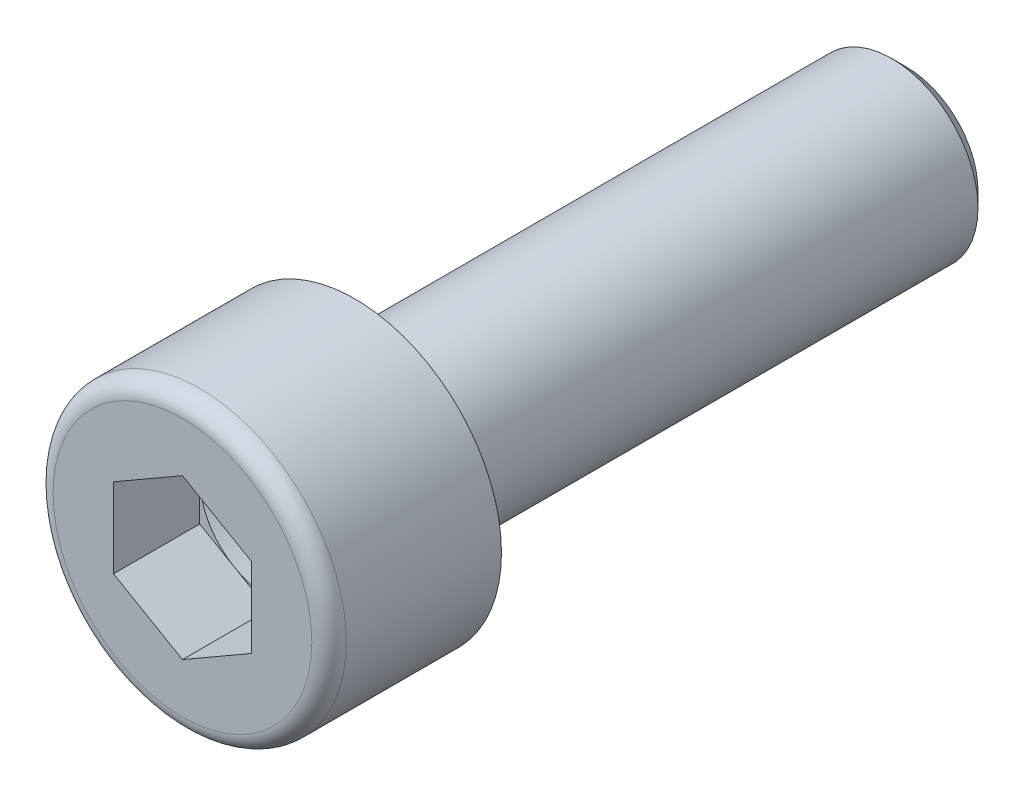
ISO-10303-21;
HEADER;
FILE_DESCRIPTION(('STEP AP214'),'2;1');
FILE_NAME('part.step','',(''),(''),'','','');
FILE_SCHEMA(('AUTOMOTIVE_DESIGN { 1 0 10303 214 1 1 1 1 }'));
ENDSEC;
DATA;
#1=APPLICATION_CONTEXT('core data for automotive mechanical design processes');
#2=APPLICATION_PROTOCOL_DEFINITION('international standard','automotive_design',2000,#1);
#3=PRODUCT_CONTEXT('',#1,'mechanical');
#4=PRODUCT('Part','Part','',(#3));
#5=PRODUCT_RELATED_PRODUCT_CATEGORY('part','',(#4));
#6=PRODUCT_DEFINITION_FORMATION('','',#4);
#7=PRODUCT_DEFINITION_CONTEXT('part definition',#1,'design');
#8=PRODUCT_DEFINITION('design','',#6,#7);
#9=PRODUCT_DEFINITION_SHAPE('','',#8);
#10=(LENGTH_UNIT() NAMED_UNIT(*) SI_UNIT(.MILLI.,.METRE.));
#11=(NAMED_UNIT(*) PLANE_ANGLE_UNIT() SI_UNIT($,.RADIAN.));
#12=(NAMED_UNIT(*) SI_UNIT($,.STERADIAN.) SOLID_ANGLE_UNIT());
#13=UNCERTAINTY_MEASURE_WITH_UNIT(LENGTH_MEASURE(1.E-05),#10,'distance_accuracy_value','');
#14=(GEOMETRIC_REPRESENTATION_CONTEXT(3) GLOBAL_UNCERTAINTY_ASSIGNED_CONTEXT((#13)) GLOBAL_UNIT_ASSIGNED_CONTEXT((#10,
#11,#12)) REPRESENTATION_CONTEXT('',''));
#15=CARTESIAN_POINT('',(0.,0.,0.));
#16=DIRECTION('',(0.,0.,1.));
#17=DIRECTION('',(1.,0.,0.));
#18=AXIS2_PLACEMENT_3D('',#15,#16,#17);
#19=CARTESIAN_POINT('',(0.,0.,-2.5));
#20=DIRECTION('',(0.,0.,1.));
#21=DIRECTION('',(1.,0.,0.));
#22=AXIS2_PLACEMENT_3D('',#19,#20,#21);
#23=PLANE('',#22);
#24=DIRECTION('',(0.,1.,0.));
#25=VECTOR('',#24,1.);
#26=CARTESIAN_POINT('',(-2.,0.,-2.5));
#27=LINE('',#26,#25);
#28=CARTESIAN_POINT('',(-2.,0.,-2.5));
#29=VERTEX_POINT('',#28);
#30=CARTESIAN_POINT('',(-2.,1.15470053837925,-2.5));
#31=VERTEX_POINT('',#30);
#32=EDGE_CURVE('E289',#29,#31,#27,.T.);
#33=ORIENTED_EDGE('',*,*,#32,.F.);
#34=CARTESIAN_POINT('',(0.,0.,-2.5));
#35=DIRECTION('',(0.,0.,-1.));
#36=DIRECTION('',(-1.,0.,0.));
#37=AXIS2_PLACEMENT_3D('',#34,#35,#36);
#38=CIRCLE('',#37,2.);
#39=CARTESIAN_POINT('',(-1.,1.73205080756888,-2.5));
#40=VERTEX_POINT('',#39);
#41=EDGE_CURVE('E38',#29,#40,#38,.T.);
#42=ORIENTED_EDGE('',*,*,#41,.T.);
#43=DIRECTION('',(0.866025403784439,0.5,0.));
#44=VECTOR('',#43,1.);
#45=CARTESIAN_POINT('',(-0.992562637900043,1.73634477057935,-2.5));
#46=LINE('',#45,#44);
#47=EDGE_CURVE('E290',#31,#40,#46,.T.);
#48=ORIENTED_EDGE('',*,*,#47,.F.);
#49=EDGE_LOOP('',(#33,#42,#48));
#50=FACE_BOUND('',#49,.T.);
#51=ADVANCED_FACE('F17',(#50),#23,.T.);
#52=CARTESIAN_POINT('',(0.,2.30940107675851,-2.5));
#53=VERTEX_POINT('',#52);
#54=EDGE_CURVE('E294',#40,#53,#46,.T.);
#55=ORIENTED_EDGE('',*,*,#54,.F.);
#56=CARTESIAN_POINT('',(1.,1.73205080756888,-2.5));
#57=VERTEX_POINT('',#56);
#58=EDGE_CURVE('E305',#40,#57,#38,.T.);
#59=ORIENTED_EDGE('',*,*,#58,.T.);
#60=DIRECTION('',(0.866025403784439,-0.5,0.));
#61=VECTOR('',#60,1.);
#62=CARTESIAN_POINT('',(1.,1.73205080756888,-2.5));
#63=LINE('',#62,#61);
#64=EDGE_CURVE('E295',#53,#57,#63,.T.);
#65=ORIENTED_EDGE('',*,*,#64,.F.);
#66=EDGE_LOOP('',(#55,#59,#65));
#67=FACE_BOUND('',#66,.T.);
#68=ADVANCED_FACE('F134',(#67),#23,.T.);
#69=CARTESIAN_POINT('',(2.,1.15470053837925,-2.5));
#70=VERTEX_POINT('',#69);
#71=EDGE_CURVE('E299',#57,#70,#63,.T.);
#72=ORIENTED_EDGE('',*,*,#71,.F.);
#73=CARTESIAN_POINT('',(2.,0.,-2.5));
#74=VERTEX_POINT('',#73);
#75=EDGE_CURVE('E313',#57,#74,#38,.T.);
#76=ORIENTED_EDGE('',*,*,#75,.T.);
#77=DIRECTION('',(0.,-1.,0.));
#78=VECTOR('',#77,1.);
#79=CARTESIAN_POINT('',(2.,0.,-2.5));
#80=LINE('',#79,#78);
#81=EDGE_CURVE('E300',#70,#74,#80,.T.);
#82=ORIENTED_EDGE('',*,*,#81,.F.);
#83=EDGE_LOOP('',(#72,#76,#82));
#84=FACE_BOUND('',#83,.T.);
#85=ADVANCED_FACE('F139',(#84),#23,.T.);
#86=CARTESIAN_POINT('',(2.,-1.15470053837925,-2.5));
#87=VERTEX_POINT('',#86);
#88=EDGE_CURVE('E257',#74,#87,#80,.T.);
#89=ORIENTED_EDGE('',*,*,#88,.F.);
#90=CARTESIAN_POINT('',(1.,-1.73205080756888,-2.5));
#91=VERTEX_POINT('',#90);
#92=EDGE_CURVE('E321',#74,#91,#38,.T.);
#93=ORIENTED_EDGE('',*,*,#92,.T.);
#94=DIRECTION('',(-0.866025403784439,-0.5,0.));
#95=VECTOR('',#94,1.);
#96=CARTESIAN_POINT('',(0.971250214161918,-1.74864950416164,-2.5));
#97=LINE('',#96,#95);
#98=EDGE_CURVE('E252',#87,#91,#97,.T.);
#99=ORIENTED_EDGE('',*,*,#98,.F.);
#100=EDGE_LOOP('',(#89,#93,#99));
#101=FACE_BOUND('',#100,.T.);
#102=ADVANCED_FACE('F338',(#101),#23,.T.);
#103=CARTESIAN_POINT('',(0.,-2.30940107675851,-2.5));
#104=VERTEX_POINT('',#103);
#105=EDGE_CURVE('E279',#91,#104,#97,.T.);
#106=ORIENTED_EDGE('',*,*,#105,.F.);
#107=CARTESIAN_POINT('',(-1.,-1.73205080756888,-2.5));
#108=VERTEX_POINT('',#107);
#109=EDGE_CURVE('E314',#91,#108,#38,.T.);
#110=ORIENTED_EDGE('',*,*,#109,.T.);
#111=DIRECTION('',(-0.866025403784439,0.5,0.));
#112=VECTOR('',#111,1.);
#113=CARTESIAN_POINT('',(-1.,-1.73205080756888,-2.5));
#114=LINE('',#113,#112);
#115=EDGE_CURVE('E280',#104,#108,#114,.T.);
#116=ORIENTED_EDGE('',*,*,#115,.F.);
#117=EDGE_LOOP('',(#106,#110,#116));
#118=FACE_BOUND('',#117,.T.);
#119=ADVANCED_FACE('F132',(#118),#23,.T.);
#120=CARTESIAN_POINT('',(-1.10172582585694,0.,0.));
#121=DIRECTION('',(0.,0.,-1.));
#122=DIRECTION('',(-1.,0.,0.));
#123=AXIS2_PLACEMENT_3D('',#120,#121,#122);
#124=PLANE('',#123);
#125=CARTESIAN_POINT('',(0.,0.,0.));
#126=DIRECTION('',(0.,0.,1.));
#127=DIRECTION('',(1.,0.,0.));
#128=AXIS2_PLACEMENT_3D('',#125,#126,#127);
#129=CIRCLE('',#128,3.75);
#130=CARTESIAN_POINT('',(3.75,0.,0.));
#131=VERTEX_POINT('',#130);
#132=EDGE_CURVE('E222',#131,#131,#129,.T.);
#133=ORIENTED_EDGE('',*,*,#132,.T.);
#134=EDGE_LOOP('',(#133));
#135=FACE_BOUND('',#134,.T.);
#136=DIRECTION('',(0.,-1.,0.));
#137=VECTOR('',#136,1.);
#138=CARTESIAN_POINT('',(2.,0.,0.));
#139=LINE('',#138,#137);
#140=CARTESIAN_POINT('',(2.,1.15470053837925,0.));
#141=VERTEX_POINT('',#140);
#142=CARTESIAN_POINT('',(2.,-1.15470053837925,0.));
#143=VERTEX_POINT('',#142);
#144=EDGE_CURVE('E272',#141,#143,#139,.T.);
#145=ORIENTED_EDGE('',*,*,#144,.T.);
#146=DIRECTION('',(-0.866025403784439,-0.5,0.));
#147=VECTOR('',#146,1.);
#148=CARTESIAN_POINT('',(0.971250214161918,-1.74864950416164,0.));
#149=LINE('',#148,#147);
#150=CARTESIAN_POINT('',(0.,-2.30940107675851,0.));
#151=VERTEX_POINT('',#150);
#152=EDGE_CURVE('E253',#143,#151,#149,.T.);
#153=ORIENTED_EDGE('',*,*,#152,.T.);
#154=DIRECTION('',(-0.866025403784439,0.5,0.));
#155=VECTOR('',#154,1.);
#156=CARTESIAN_POINT('',(-1.,-1.73205080756888,0.));
#157=LINE('',#156,#155);
#158=CARTESIAN_POINT('',(-2.,-1.15470053837925,0.));
#159=VERTEX_POINT('',#158);
#160=EDGE_CURVE('E50',#151,#159,#157,.T.);
#161=ORIENTED_EDGE('',*,*,#160,.T.);
#162=DIRECTION('',(0.,1.,0.));
#163=VECTOR('',#162,1.);
#164=CARTESIAN_POINT('',(-2.,0.,0.));
#165=LINE('',#164,#163);
#166=CARTESIAN_POINT('',(-2.,1.15470053837925,0.));
#167=VERTEX_POINT('',#166);
#168=EDGE_CURVE('E260',#159,#167,#165,.T.);
#169=ORIENTED_EDGE('',*,*,#168,.T.);
#170=DIRECTION('',(0.866025403784439,0.5,0.));
#171=VECTOR('',#170,1.);
#172=CARTESIAN_POINT('',(-0.992562637900043,1.73634477057935,0.));
#173=LINE('',#172,#171);
#174=CARTESIAN_POINT('',(0.,2.30940107675851,0.));
#175=VERTEX_POINT('',#174);
#176=EDGE_CURVE('E264',#167,#175,#173,.T.);
#177=ORIENTED_EDGE('',*,*,#176,.T.);
#178=DIRECTION('',(0.866025403784439,-0.5,0.));
#179=VECTOR('',#178,1.);
#180=CARTESIAN_POINT('',(1.,1.73205080756888,0.));
#181=LINE('',#180,#179);
#182=EDGE_CURVE('E268',#175,#141,#181,.T.);
#183=ORIENTED_EDGE('',*,*,#182,.T.);
#184=EDGE_LOOP('',(#145,#153,#161,#169,#177,#183));
#185=FACE_BOUND('',#184,.T.);
#186=ADVANCED_FACE('F184',(#135,#185),#124,.F.);
#187=CARTESIAN_POINT('',(0.,0.,-0.5));
#188=DIRECTION('',(0.,0.,1.));
#189=DIRECTION('',(1.,0.,0.));
#190=AXIS2_PLACEMENT_3D('',#187,#188,#189);
#191=TOROIDAL_SURFACE('',#190,3.75,0.5);
#192=CARTESIAN_POINT('',(0.,0.,-0.5));
#193=DIRECTION('',(0.,0.,1.));
#194=DIRECTION('',(1.,0.,0.));
#195=AXIS2_PLACEMENT_3D('',#192,#193,#194);
#196=CIRCLE('',#195,4.25);
#197=CARTESIAN_POINT('',(4.25,0.,-0.5));
#198=VERTEX_POINT('',#197);
#199=EDGE_CURVE('E226',#198,#198,#196,.T.);
#200=ORIENTED_EDGE('',*,*,#199,.T.);
#201=EDGE_LOOP('',(#200));
#202=FACE_BOUND('',#201,.T.);
#203=ORIENTED_EDGE('',*,*,#132,.F.);
#204=EDGE_LOOP('',(#203));
#205=FACE_BOUND('',#204,.T.);
#206=ADVANCED_FACE('F180',(#202,#205),#191,.T.);
#207=CARTESIAN_POINT('',(0.,0.,-10.5));
#208=DIRECTION('',(0.,0.,1.));
#209=DIRECTION('',(1.,0.,0.));
#210=AXIS2_PLACEMENT_3D('',#207,#208,#209);
#211=CYLINDRICAL_SURFACE('',#210,4.25);
#212=ORIENTED_EDGE('',*,*,#199,.F.);
#213=EDGE_LOOP('',(#212));
#214=FACE_BOUND('',#213,.T.);
#215=CARTESIAN_POINT('',(0.,0.,-5.));
#216=DIRECTION('',(0.,0.,1.));
#217=DIRECTION('',(1.,0.,0.));
#218=AXIS2_PLACEMENT_3D('',#215,#216,#217);
#219=CIRCLE('',#218,4.25);
#220=CARTESIAN_POINT('',(4.25,0.,-5.));
#221=VERTEX_POINT('',#220);
#222=EDGE_CURVE('E230',#221,#221,#219,.T.);
#223=ORIENTED_EDGE('',*,*,#222,.T.);
#224=EDGE_LOOP('',(#223));
#225=FACE_BOUND('',#224,.T.);
#226=ADVANCED_FACE('F176',(#214,#225),#211,.T.);
#227=CARTESIAN_POINT('',(-1.61056634651914,0.,-5.));
#228=DIRECTION('',(0.,0.,1.));
#229=DIRECTION('',(1.,0.,0.));
#230=AXIS2_PLACEMENT_3D('',#227,#228,#229);
#231=PLANE('',#230);
#232=CARTESIAN_POINT('',(0.,0.,-5.));
#233=DIRECTION('',(0.,0.,1.));
#234=DIRECTION('',(1.,0.,0.));
#235=AXIS2_PLACEMENT_3D('',#232,#233,#234);
#236=CIRCLE('',#235,2.96487406649082);
#237=CARTESIAN_POINT('',(2.96487406649082,0.,-5.));
#238=VERTEX_POINT('',#237);
#239=EDGE_CURVE('E204',#238,#238,#236,.T.);
#240=ORIENTED_EDGE('',*,*,#239,.T.);
#241=EDGE_LOOP('',(#240));
#242=FACE_BOUND('',#241,.T.);
#243=ORIENTED_EDGE('',*,*,#222,.F.);
#244=EDGE_LOOP('',(#243));
#245=FACE_BOUND('',#244,.T.);
#246=ADVANCED_FACE('F172',(#242,#245),#231,.F.);
#247=CARTESIAN_POINT('',(0.,0.,-10.5));
#248=DIRECTION('',(0.,0.,1.));
#249=DIRECTION('',(1.,0.,0.));
#250=AXIS2_PLACEMENT_3D('',#247,#248,#249);
#251=CYLINDRICAL_SURFACE('',#250,2.5);
#252=CARTESIAN_POINT('',(0.,0.,-20.5669873));
#253=DIRECTION('',(0.,0.,1.));
#254=DIRECTION('',(1.,0.,0.));
#255=AXIS2_PLACEMENT_3D('',#252,#253,#254);
#256=CIRCLE('',#255,2.5);
#257=CARTESIAN_POINT('',(2.5,0.,-20.5669873));
#258=VERTEX_POINT('',#257);
#259=EDGE_CURVE('E26',#258,#258,#256,.T.);
#260=ORIENTED_EDGE('',*,*,#259,.T.);
#261=EDGE_LOOP('',(#260));
#262=FACE_BOUND('',#261,.T.);
#263=CARTESIAN_POINT('',(0.,0.,-5.65406982827));
#264=DIRECTION('',(0.,0.,-1.));
#265=DIRECTION('',(-1.,0.,0.));
#266=AXIS2_PLACEMENT_3D('',#263,#264,#265);
#267=CIRCLE('',#266,2.5);
#268=CARTESIAN_POINT('',(-2.5,0.,-5.65406982827));
#269=VERTEX_POINT('',#268);
#270=EDGE_CURVE('E218',#269,#269,#267,.T.);
#271=ORIENTED_EDGE('',*,*,#270,.T.);
#272=EDGE_LOOP('',(#271));
#273=FACE_BOUND('',#272,.T.);
#274=ADVANCED_FACE('F168',(#262,#273),#251,.T.);
#275=CARTESIAN_POINT('',(-0.508840520662191,0.,-21.));
#276=DIRECTION('',(0.,0.,1.));
#277=DIRECTION('',(1.,0.,0.));
#278=AXIS2_PLACEMENT_3D('',#275,#276,#277);
#279=PLANE('',#278);
#280=CARTESIAN_POINT('',(0.,0.,-21.));
#281=DIRECTION('',(0.,0.,1.));
#282=DIRECTION('',(1.,0.,0.));
#283=AXIS2_PLACEMENT_3D('',#280,#281,#282);
#284=CIRCLE('',#283,2.06698729999999);
#285=CARTESIAN_POINT('',(2.06698729999999,0.,-21.));
#286=VERTEX_POINT('',#285);
#287=EDGE_CURVE('E11',#286,#286,#284,.F.);
#288=ORIENTED_EDGE('',*,*,#287,.T.);
#289=EDGE_LOOP('',(#288));
#290=FACE_BOUND('',#289,.T.);
#291=ADVANCED_FACE('F164',(#290),#279,.F.);
#292=CARTESIAN_POINT('',(2.,0.,-2.5));
#293=DIRECTION('',(-1.,0.,0.));
#294=DIRECTION('',(0.,-1.,0.));
#295=AXIS2_PLACEMENT_3D('',#292,#293,#294);
#296=PLANE('',#295);
#297=ORIENTED_EDGE('',*,*,#144,.F.);
#298=DIRECTION('',(0.,0.,1.));
#299=VECTOR('',#298,1.);
#300=CARTESIAN_POINT('',(2.,1.15470053837925,-2.5));
#301=LINE('',#300,#299);
#302=EDGE_CURVE('E234',#70,#141,#301,.T.);
#303=ORIENTED_EDGE('',*,*,#302,.F.);
#304=ORIENTED_EDGE('',*,*,#81,.T.);
#305=ORIENTED_EDGE('',*,*,#88,.T.);
#306=DIRECTION('',(0.,0.,1.));
#307=VECTOR('',#306,1.);
#308=CARTESIAN_POINT('',(2.,-1.15470053837925,-2.5));
#309=LINE('',#308,#307);
#310=EDGE_CURVE('E249',#87,#143,#309,.T.);
#311=ORIENTED_EDGE('',*,*,#310,.T.);
#312=EDGE_LOOP('',(#297,#303,#304,#305,#311));
#313=FACE_BOUND('',#312,.T.);
#314=ADVANCED_FACE('F160',(#313),#296,.T.);
#315=CARTESIAN_POINT('',(1.,1.73205080756888,-2.5));
#316=DIRECTION('',(-0.5,-0.866025403784439,0.));
#317=DIRECTION('',(0.866025403784439,-0.5,0.));
#318=AXIS2_PLACEMENT_3D('',#315,#316,#317);
#319=PLANE('',#318);
#320=ORIENTED_EDGE('',*,*,#182,.F.);
#321=DIRECTION('',(0.,0.,1.));
#322=VECTOR('',#321,1.);
#323=CARTESIAN_POINT('',(0.,2.30940107675851,-2.5));
#324=LINE('',#323,#322);
#325=EDGE_CURVE('E237',#53,#175,#324,.T.);
#326=ORIENTED_EDGE('',*,*,#325,.F.);
#327=ORIENTED_EDGE('',*,*,#64,.T.);
#328=ORIENTED_EDGE('',*,*,#71,.T.);
#329=ORIENTED_EDGE('',*,*,#302,.T.);
#330=EDGE_LOOP('',(#320,#326,#327,#328,#329));
#331=FACE_BOUND('',#330,.T.);
#332=ADVANCED_FACE('F156',(#331),#319,.T.);
#333=CARTESIAN_POINT('',(-0.992562637900043,1.73634477057935,-2.5));
#334=DIRECTION('',(0.5,-0.866025403784439,0.));
#335=DIRECTION('',(0.866025403784439,0.5,0.));
#336=AXIS2_PLACEMENT_3D('',#333,#334,#335);
#337=PLANE('',#336);
#338=ORIENTED_EDGE('',*,*,#176,.F.);
#339=DIRECTION('',(0.,0.,1.));
#340=VECTOR('',#339,1.);
#341=CARTESIAN_POINT('',(-2.,1.15470053837925,-2.5));
#342=LINE('',#341,#340);
#343=EDGE_CURVE('E240',#31,#167,#342,.T.);
#344=ORIENTED_EDGE('',*,*,#343,.F.);
#345=ORIENTED_EDGE('',*,*,#47,.T.);
#346=ORIENTED_EDGE('',*,*,#54,.T.);
#347=ORIENTED_EDGE('',*,*,#325,.T.);
#348=EDGE_LOOP('',(#338,#344,#345,#346,#347));
#349=FACE_BOUND('',#348,.T.);
#350=ADVANCED_FACE('F152',(#349),#337,.T.);
#351=CARTESIAN_POINT('',(-2.,0.,-2.5));
#352=DIRECTION('',(1.,0.,0.));
#353=DIRECTION('',(0.,1.,0.));
#354=AXIS2_PLACEMENT_3D('',#351,#352,#353);
#355=PLANE('',#354);
#356=ORIENTED_EDGE('',*,*,#168,.F.);
#357=DIRECTION('',(0.,0.,1.));
#358=VECTOR('',#357,1.);
#359=CARTESIAN_POINT('',(-2.,-1.15470053837925,-2.5));
#360=LINE('',#359,#358);
#361=CARTESIAN_POINT('',(-2.,-1.15470053837925,-2.5));
#362=VERTEX_POINT('',#361);
#363=EDGE_CURVE('E243',#362,#159,#360,.T.);
#364=ORIENTED_EDGE('',*,*,#363,.F.);
#365=EDGE_CURVE('E285',#362,#29,#27,.T.);
#366=ORIENTED_EDGE('',*,*,#365,.T.);
#367=ORIENTED_EDGE('',*,*,#32,.T.);
#368=ORIENTED_EDGE('',*,*,#343,.T.);
#369=EDGE_LOOP('',(#356,#364,#366,#367,#368));
#370=FACE_BOUND('',#369,.T.);
#371=ADVANCED_FACE('F149',(#370),#355,.T.);
#372=CARTESIAN_POINT('',(-1.,-1.73205080756888,-2.5));
#373=DIRECTION('',(0.5,0.866025403784439,0.));
#374=DIRECTION('',(-0.866025403784439,0.5,0.));
#375=AXIS2_PLACEMENT_3D('',#372,#373,#374);
#376=PLANE('',#375);
#377=ORIENTED_EDGE('',*,*,#160,.F.);
#378=DIRECTION('',(0.,0.,1.));
#379=VECTOR('',#378,1.);
#380=CARTESIAN_POINT('',(0.,-2.30940107675851,-2.5));
#381=LINE('',#380,#379);
#382=EDGE_CURVE('E246',#104,#151,#381,.T.);
#383=ORIENTED_EDGE('',*,*,#382,.F.);
#384=ORIENTED_EDGE('',*,*,#115,.T.);
#385=EDGE_CURVE('E284',#108,#362,#114,.T.);
#386=ORIENTED_EDGE('',*,*,#385,.T.);
#387=ORIENTED_EDGE('',*,*,#363,.T.);
#388=EDGE_LOOP('',(#377,#383,#384,#386,#387));
#389=FACE_BOUND('',#388,.T.);
#390=ADVANCED_FACE('F145',(#389),#376,.T.);
#391=CARTESIAN_POINT('',(0.971250214161918,-1.74864950416164,-2.5));
#392=DIRECTION('',(-0.5,0.866025403784439,0.));
#393=DIRECTION('',(-0.866025403784439,-0.5,0.));
#394=AXIS2_PLACEMENT_3D('',#391,#392,#393);
#395=PLANE('',#394);
#396=ORIENTED_EDGE('',*,*,#152,.F.);
#397=ORIENTED_EDGE('',*,*,#310,.F.);
#398=ORIENTED_EDGE('',*,*,#98,.T.);
#399=ORIENTED_EDGE('',*,*,#105,.T.);
#400=ORIENTED_EDGE('',*,*,#382,.T.);
#401=EDGE_LOOP('',(#396,#397,#398,#399,#400));
#402=FACE_BOUND('',#401,.T.);
#403=ADVANCED_FACE('F129',(#402),#395,.T.);
#404=ORIENTED_EDGE('',*,*,#385,.F.);
#405=EDGE_CURVE('E306',#108,#29,#38,.T.);
#406=ORIENTED_EDGE('',*,*,#405,.T.);
#407=ORIENTED_EDGE('',*,*,#365,.F.);
#408=EDGE_LOOP('',(#404,#406,#407));
#409=FACE_BOUND('',#408,.T.);
#410=ADVANCED_FACE('F119',(#409),#23,.T.);
#411=CARTESIAN_POINT('',(0.,0.,-2.5));
#412=DIRECTION('',(0.,0.,1.));
#413=DIRECTION('',(1.,0.,0.));
#414=AXIS2_PLACEMENT_3D('',#411,#412,#413);
#415=CONICAL_SURFACE('',#414,2.,1.22173047639603);
#416=CARTESIAN_POINT('',(0.,0.,-3.2279404685324));
#417=VERTEX_POINT('',#416);
#418=VERTEX_LOOP('',#417);
#419=FACE_BOUND('',#418,.T.);
#420=ORIENTED_EDGE('',*,*,#41,.F.);
#421=ORIENTED_EDGE('',*,*,#405,.F.);
#422=ORIENTED_EDGE('',*,*,#109,.F.);
#423=ORIENTED_EDGE('',*,*,#92,.F.);
#424=ORIENTED_EDGE('',*,*,#75,.F.);
#425=ORIENTED_EDGE('',*,*,#58,.F.);
#426=EDGE_LOOP('',(#420,#421,#422,#423,#424,#425));
#427=FACE_BOUND('',#426,.T.);
#428=ADVANCED_FACE('F116',(#419,#427),#415,.F.);
#429=CARTESIAN_POINT('',(0.,0.,-5.));
#430=DIRECTION('',(0.,0.,1.));
#431=DIRECTION('',(1.,0.,0.));
#432=AXIS2_PLACEMENT_3D('',#429,#430,#431);
#433=CONICAL_SURFACE('',#432,2.85,0.528074448426359);
#434=CARTESIAN_POINT('',(0.,0.,-5.55329562316518));
#435=DIRECTION('',(0.,0.,1.));
#436=DIRECTION('',(1.,0.,0.));
#437=AXIS2_PLACEMENT_3D('',#434,#435,#436);
#438=CIRCLE('',#437,2.52724421982031);
#439=CARTESIAN_POINT('',(2.52724421982031,0.,-5.55329562316518));
#440=VERTEX_POINT('',#439);
#441=EDGE_CURVE('E206',#440,#440,#438,.T.);
#442=ORIENTED_EDGE('',*,*,#441,.T.);
#443=EDGE_LOOP('',(#442));
#444=FACE_BOUND('',#443,.T.);
#445=CARTESIAN_POINT('',(0.,0.,-5.09922579489518));
#446=DIRECTION('',(0.,0.,1.));
#447=DIRECTION('',(1.,0.,0.));
#448=AXIS2_PLACEMENT_3D('',#445,#446,#447);
#449=CIRCLE('',#448,2.79211828631114);
#450=CARTESIAN_POINT('',(2.79211828631114,0.,-5.09922579489518));
#451=VERTEX_POINT('',#450);
#452=EDGE_CURVE('E201',#451,#451,#449,.F.);
#453=ORIENTED_EDGE('',*,*,#452,.T.);
#454=EDGE_LOOP('',(#453));
#455=FACE_BOUND('',#454,.T.);
#456=ADVANCED_FACE('F118',(#444,#455),#433,.T.);
#457=CARTESIAN_POINT('',(0.,0.,-5.65406982827));
#458=DIRECTION('',(0.,0.,-1.));
#459=DIRECTION('',(-1.,0.,0.));
#460=AXIS2_PLACEMENT_3D('',#457,#458,#459);
#461=TOROIDAL_SURFACE('',#460,2.7,0.2);
#462=ORIENTED_EDGE('',*,*,#441,.F.);
#463=EDGE_LOOP('',(#462));
#464=FACE_BOUND('',#463,.T.);
#465=ORIENTED_EDGE('',*,*,#270,.F.);
#466=EDGE_LOOP('',(#465));
#467=FACE_BOUND('',#466,.T.);
#468=ADVANCED_FACE('F126',(#464,#467),#461,.F.);
#469=CARTESIAN_POINT('',(0.,0.,-5.2));
#470=DIRECTION('',(0.,0.,1.));
#471=DIRECTION('',(1.,0.,0.));
#472=AXIS2_PLACEMENT_3D('',#469,#470,#471);
#473=TOROIDAL_SURFACE('',#472,2.96487406649082,0.2);
#474=ORIENTED_EDGE('',*,*,#452,.F.);
#475=EDGE_LOOP('',(#474));
#476=FACE_BOUND('',#475,.T.);
#477=ORIENTED_EDGE('',*,*,#239,.F.);
#478=EDGE_LOOP('',(#477));
#479=FACE_BOUND('',#478,.T.);
#480=ADVANCED_FACE('F190',(#476,#479),#473,.F.);
#481=CARTESIAN_POINT('',(0.,0.,-20.5669873));
#482=DIRECTION('',(0.,0.,1.));
#483=DIRECTION('',(1.,0.,0.));
#484=AXIS2_PLACEMENT_3D('',#481,#482,#483);
#485=CONICAL_SURFACE('',#484,2.5,0.785398163397449);
#486=ORIENTED_EDGE('',*,*,#287,.F.);
#487=EDGE_LOOP('',(#486));
#488=FACE_BOUND('',#487,.T.);
#489=ORIENTED_EDGE('',*,*,#259,.F.);
#490=EDGE_LOOP('',(#489));
#491=FACE_BOUND('',#490,.T.);
#492=ADVANCED_FACE('F19',(#488,#491),#485,.T.);
#493=CLOSED_SHELL('',(#51,#68,#85,#102,#119,#186,#206,#226,#246,#274,#291,#314,#332,#350,#371,
#390,#403,#410,#428,#456,#468,#480,#492));
#494=MANIFOLD_SOLID_BREP('B1',#493);
#495=ADVANCED_BREP_SHAPE_REPRESENTATION('',(#18,#494),#14);
#496=SHAPE_DEFINITION_REPRESENTATION(#9,#495);
ENDSEC;
END-ISO-10303-21;
